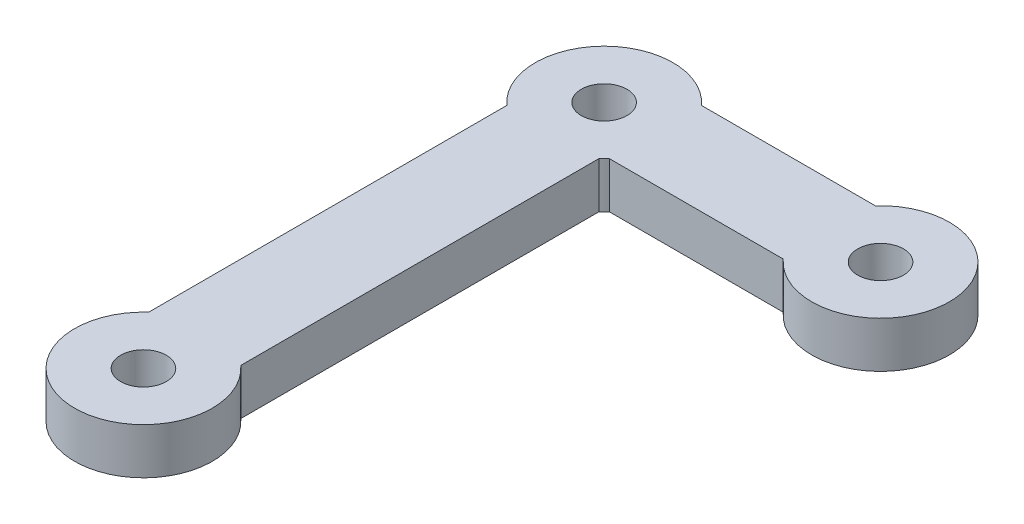
ISO-10303-21;
HEADER;
FILE_DESCRIPTION(('STEP AP214'),'2;1');
FILE_NAME('part.step','',(''),(''),'','','');
FILE_SCHEMA(('AUTOMOTIVE_DESIGN { 1 0 10303 214 1 1 1 1 }'));
ENDSEC;
DATA;
#1=APPLICATION_CONTEXT('core data for automotive mechanical design processes');
#2=APPLICATION_PROTOCOL_DEFINITION('international standard','automotive_design',2000,#1);
#3=PRODUCT_CONTEXT('',#1,'mechanical');
#4=PRODUCT('Part','Part','',(#3));
#5=PRODUCT_RELATED_PRODUCT_CATEGORY('part','',(#4));
#6=PRODUCT_DEFINITION_FORMATION('','',#4);
#7=PRODUCT_DEFINITION_CONTEXT('part definition',#1,'design');
#8=PRODUCT_DEFINITION('design','',#6,#7);
#9=PRODUCT_DEFINITION_SHAPE('','',#8);
#10=(LENGTH_UNIT() NAMED_UNIT(*) SI_UNIT(.MILLI.,.METRE.));
#11=(NAMED_UNIT(*) PLANE_ANGLE_UNIT() SI_UNIT($,.RADIAN.));
#12=(NAMED_UNIT(*) SI_UNIT($,.STERADIAN.) SOLID_ANGLE_UNIT());
#13=UNCERTAINTY_MEASURE_WITH_UNIT(LENGTH_MEASURE(1.E-05),#10,'distance_accuracy_value','');
#14=(GEOMETRIC_REPRESENTATION_CONTEXT(3) GLOBAL_UNCERTAINTY_ASSIGNED_CONTEXT((#13)) GLOBAL_UNIT_ASSIGNED_CONTEXT((#10,
#11,#12)) REPRESENTATION_CONTEXT('',''));
#15=CARTESIAN_POINT('',(0.,0.,0.));
#16=DIRECTION('',(0.,0.,1.));
#17=DIRECTION('',(1.,0.,0.));
#18=AXIS2_PLACEMENT_3D('',#15,#16,#17);
#19=CARTESIAN_POINT('',(-32.2589762582874,-15.7067029241854,-2.73641625173114));
#20=DIRECTION('',(0.,-1.,0.));
#21=DIRECTION('',(0.,0.,-1.));
#22=AXIS2_PLACEMENT_3D('',#19,#20,#21);
#23=CYLINDRICAL_SURFACE('',#22,4.75);
#24=DIRECTION('',(0.,-1.,0.));
#25=VECTOR('',#24,1.);
#26=CARTESIAN_POINT('',(-28.7260065442933,6.67638257835148,0.438583748268859));
#27=LINE('',#26,#25);
#28=CARTESIAN_POINT('',(-28.7260065442933,-15.7067029241854,0.438583748268859));
#29=VERTEX_POINT('',#28);
#30=CARTESIAN_POINT('',(-28.7260065442933,-18.8817029241854,0.438583748268859));
#31=VERTEX_POINT('',#30);
#32=EDGE_CURVE('E58',#29,#31,#27,.T.);
#33=ORIENTED_EDGE('',*,*,#32,.F.);
#34=CARTESIAN_POINT('',(-32.2589762582874,-15.7067029241854,-2.73641625173114));
#35=DIRECTION('',(0.,1.,0.));
#36=DIRECTION('',(0.,0.,1.));
#37=AXIS2_PLACEMENT_3D('',#34,#35,#36);
#38=CIRCLE('',#37,4.75);
#39=CARTESIAN_POINT('',(-29.0839762582874,-15.7067029241854,0.796553462263021));
#40=VERTEX_POINT('',#39);
#41=EDGE_CURVE('E108',#40,#29,#38,.T.);
#42=ORIENTED_EDGE('',*,*,#41,.F.);
#43=DIRECTION('',(0.,-1.,0.));
#44=VECTOR('',#43,1.);
#45=CARTESIAN_POINT('',(-29.0839762582874,-15.7067029241854,0.796553462263021));
#46=LINE('',#45,#44);
#47=CARTESIAN_POINT('',(-29.0839762582874,-18.8817029241854,0.796553462263021));
#48=VERTEX_POINT('',#47);
#49=EDGE_CURVE('E43',#40,#48,#46,.T.);
#50=ORIENTED_EDGE('',*,*,#49,.T.);
#51=CARTESIAN_POINT('',(-32.2589762582874,-18.8817029241854,-2.73641625173114));
#52=DIRECTION('',(0.,1.,0.));
#53=DIRECTION('',(0.,0.,1.));
#54=AXIS2_PLACEMENT_3D('',#51,#52,#53);
#55=CIRCLE('',#54,4.75);
#56=EDGE_CURVE('E163',#48,#31,#55,.T.);
#57=ORIENTED_EDGE('',*,*,#56,.T.);
#58=EDGE_LOOP('',(#33,#42,#50,#57));
#59=FACE_BOUND('',#58,.T.);
#60=ADVANCED_FACE('F35',(#59),#23,.T.);
#61=CARTESIAN_POINT('',(-32.2589762582874,-15.7067029241854,29.0135837482689));
#62=DIRECTION('',(0.,-1.,0.));
#63=DIRECTION('',(0.,0.,-1.));
#64=AXIS2_PLACEMENT_3D('',#61,#62,#63);
#65=CYLINDRICAL_SURFACE('',#64,4.75);
#66=CARTESIAN_POINT('',(-32.2589762582874,-18.8817029241854,29.0135837482689));
#67=DIRECTION('',(0.,1.,0.));
#68=DIRECTION('',(0.,0.,1.));
#69=AXIS2_PLACEMENT_3D('',#66,#67,#68);
#70=CIRCLE('',#69,4.75);
#71=CARTESIAN_POINT('',(-35.4339762582874,-18.8817029241854,25.4806140342747));
#72=VERTEX_POINT('',#71);
#73=CARTESIAN_POINT('',(-29.0839762582874,-18.8817029241854,25.4806140342747));
#74=VERTEX_POINT('',#73);
#75=EDGE_CURVE('E156',#72,#74,#70,.T.);
#76=ORIENTED_EDGE('',*,*,#75,.T.);
#77=DIRECTION('',(0.,-1.,0.));
#78=VECTOR('',#77,1.);
#79=CARTESIAN_POINT('',(-29.0839762582874,-15.7067029241854,25.4806140342747));
#80=LINE('',#79,#78);
#81=CARTESIAN_POINT('',(-29.0839762582874,-15.7067029241854,25.4806140342747));
#82=VERTEX_POINT('',#81);
#83=EDGE_CURVE('E11',#82,#74,#80,.T.);
#84=ORIENTED_EDGE('',*,*,#83,.F.);
#85=CARTESIAN_POINT('',(-32.2589762582874,-15.7067029241854,29.0135837482689));
#86=DIRECTION('',(0.,1.,0.));
#87=DIRECTION('',(0.,0.,1.));
#88=AXIS2_PLACEMENT_3D('',#85,#86,#87);
#89=CIRCLE('',#88,4.75);
#90=CARTESIAN_POINT('',(-35.4339762582874,-15.7067029241854,25.4806140342747));
#91=VERTEX_POINT('',#90);
#92=EDGE_CURVE('E140',#91,#82,#89,.T.);
#93=ORIENTED_EDGE('',*,*,#92,.F.);
#94=DIRECTION('',(0.,-1.,0.));
#95=VECTOR('',#94,1.);
#96=CARTESIAN_POINT('',(-35.4339762582874,-15.7067029241854,25.4806140342747));
#97=LINE('',#96,#95);
#98=EDGE_CURVE('E152',#91,#72,#97,.T.);
#99=ORIENTED_EDGE('',*,*,#98,.T.);
#100=EDGE_LOOP('',(#76,#84,#93,#99));
#101=FACE_BOUND('',#100,.T.);
#102=ADVANCED_FACE('F184',(#101),#65,.T.);
#103=CARTESIAN_POINT('',(-29.0839762582874,-15.7067029241854,-2.73641625173114));
#104=DIRECTION('',(1.,0.,0.));
#105=DIRECTION('',(0.,0.,-1.));
#106=AXIS2_PLACEMENT_3D('',#103,#104,#105);
#107=PLANE('',#106);
#108=DIRECTION('',(0.,0.,1.));
#109=VECTOR('',#108,1.);
#110=CARTESIAN_POINT('',(-29.0839762582874,-18.8817029241854,-2.73641625173114));
#111=LINE('',#110,#109);
#112=EDGE_CURVE('E159',#48,#74,#111,.T.);
#113=ORIENTED_EDGE('',*,*,#112,.F.);
#114=ORIENTED_EDGE('',*,*,#49,.F.);
#115=DIRECTION('',(0.,0.,1.));
#116=VECTOR('',#115,1.);
#117=CARTESIAN_POINT('',(-29.0839762582874,-15.7067029241854,-2.73641625173114));
#118=LINE('',#117,#116);
#119=EDGE_CURVE('E143',#40,#82,#118,.T.);
#120=ORIENTED_EDGE('',*,*,#119,.T.);
#121=ORIENTED_EDGE('',*,*,#83,.T.);
#122=EDGE_LOOP('',(#113,#114,#120,#121));
#123=FACE_BOUND('',#122,.T.);
#124=ADVANCED_FACE('F180',(#123),#107,.T.);
#125=CARTESIAN_POINT('',(-28.7260065442933,-15.7067029241854,-5.91141625173114));
#126=VERTEX_POINT('',#125);
#127=CARTESIAN_POINT('',(-35.4339762582874,-15.7067029241854,0.796553462263021));
#128=VERTEX_POINT('',#127);
#129=EDGE_CURVE('E50',#126,#128,#38,.T.);
#130=ORIENTED_EDGE('',*,*,#129,.F.);
#131=DIRECTION('',(0.,-1.,0.));
#132=VECTOR('',#131,1.);
#133=CARTESIAN_POINT('',(-28.7260065442933,6.67638257835148,-5.91141625173114));
#134=LINE('',#133,#132);
#135=CARTESIAN_POINT('',(-28.7260065442933,-18.8817029241854,-5.91141625173114));
#136=VERTEX_POINT('',#135);
#137=EDGE_CURVE('E133',#126,#136,#134,.T.);
#138=ORIENTED_EDGE('',*,*,#137,.T.);
#139=CARTESIAN_POINT('',(-35.4339762582874,-18.8817029241854,0.796553462263021));
#140=VERTEX_POINT('',#139);
#141=EDGE_CURVE('E162',#136,#140,#55,.T.);
#142=ORIENTED_EDGE('',*,*,#141,.T.);
#143=DIRECTION('',(0.,-1.,0.));
#144=VECTOR('',#143,1.);
#145=CARTESIAN_POINT('',(-35.4339762582874,-15.7067029241854,0.796553462263021));
#146=LINE('',#145,#144);
#147=EDGE_CURVE('E171',#128,#140,#146,.T.);
#148=ORIENTED_EDGE('',*,*,#147,.F.);
#149=EDGE_LOOP('',(#130,#138,#142,#148));
#150=FACE_BOUND('',#149,.T.);
#151=ADVANCED_FACE('F191',(#150),#23,.T.);
#152=CARTESIAN_POINT('',(-35.4339762582874,-15.7067029241854,-2.73641625173114));
#153=DIRECTION('',(1.,0.,0.));
#154=DIRECTION('',(0.,0.,-1.));
#155=AXIS2_PLACEMENT_3D('',#152,#153,#154);
#156=PLANE('',#155);
#157=DIRECTION('',(0.,0.,1.));
#158=VECTOR('',#157,1.);
#159=CARTESIAN_POINT('',(-35.4339762582874,-18.8817029241854,-2.73641625173114));
#160=LINE('',#159,#158);
#161=EDGE_CURVE('E165',#140,#72,#160,.T.);
#162=ORIENTED_EDGE('',*,*,#161,.T.);
#163=ORIENTED_EDGE('',*,*,#98,.F.);
#164=DIRECTION('',(0.,0.,1.));
#165=VECTOR('',#164,1.);
#166=CARTESIAN_POINT('',(-35.4339762582874,-15.7067029241854,-2.73641625173114));
#167=LINE('',#166,#165);
#168=EDGE_CURVE('E147',#128,#91,#167,.T.);
#169=ORIENTED_EDGE('',*,*,#168,.F.);
#170=ORIENTED_EDGE('',*,*,#147,.T.);
#171=EDGE_LOOP('',(#162,#163,#169,#170));
#172=FACE_BOUND('',#171,.T.);
#173=ADVANCED_FACE('F189',(#172),#156,.F.);
#174=CARTESIAN_POINT('',(-32.2589762582874,-15.7067029241854,29.0135837482689));
#175=DIRECTION('',(0.,-1.,0.));
#176=DIRECTION('',(0.,0.,-1.));
#177=AXIS2_PLACEMENT_3D('',#174,#175,#176);
#178=CYLINDRICAL_SURFACE('',#177,1.575);
#179=CARTESIAN_POINT('',(-32.2589762582874,-15.7067029241854,29.0135837482689));
#180=DIRECTION('',(0.,1.,0.));
#181=DIRECTION('',(0.,0.,1.));
#182=AXIS2_PLACEMENT_3D('',#179,#180,#181);
#183=CIRCLE('',#182,1.575);
#184=CARTESIAN_POINT('',(-32.2589762582874,-15.7067029241854,30.5885837482689));
#185=VERTEX_POINT('',#184);
#186=EDGE_CURVE('E137',#185,#185,#183,.T.);
#187=ORIENTED_EDGE('',*,*,#186,.T.);
#188=EDGE_LOOP('',(#187));
#189=FACE_BOUND('',#188,.T.);
#190=CARTESIAN_POINT('',(-32.2589762582874,-18.8817029241854,29.0135837482689));
#191=DIRECTION('',(0.,1.,0.));
#192=DIRECTION('',(0.,0.,1.));
#193=AXIS2_PLACEMENT_3D('',#190,#191,#192);
#194=CIRCLE('',#193,1.575);
#195=CARTESIAN_POINT('',(-32.2589762582874,-18.8817029241854,30.5885837482689));
#196=VERTEX_POINT('',#195);
#197=EDGE_CURVE('E153',#196,#196,#194,.T.);
#198=ORIENTED_EDGE('',*,*,#197,.F.);
#199=EDGE_LOOP('',(#198));
#200=FACE_BOUND('',#199,.T.);
#201=ADVANCED_FACE('F37',(#189,#200),#178,.F.);
#202=CARTESIAN_POINT('',(-32.2589762582874,-15.7067029241854,-2.73641625173114));
#203=DIRECTION('',(0.,-1.,0.));
#204=DIRECTION('',(0.,0.,-1.));
#205=AXIS2_PLACEMENT_3D('',#202,#203,#204);
#206=CYLINDRICAL_SURFACE('',#205,1.575);
#207=CARTESIAN_POINT('',(-32.2589762582874,-15.7067029241854,-2.73641625173114));
#208=DIRECTION('',(0.,1.,0.));
#209=DIRECTION('',(0.,0.,1.));
#210=AXIS2_PLACEMENT_3D('',#207,#208,#209);
#211=CIRCLE('',#210,1.575);
#212=CARTESIAN_POINT('',(-32.2589762582874,-15.7067029241854,-1.16141625173114));
#213=VERTEX_POINT('',#212);
#214=EDGE_CURVE('E149',#213,#213,#211,.T.);
#215=ORIENTED_EDGE('',*,*,#214,.T.);
#216=EDGE_LOOP('',(#215));
#217=FACE_BOUND('',#216,.T.);
#218=CARTESIAN_POINT('',(-32.2589762582874,-18.8817029241854,-2.73641625173114));
#219=DIRECTION('',(0.,1.,0.));
#220=DIRECTION('',(0.,0.,1.));
#221=AXIS2_PLACEMENT_3D('',#218,#219,#220);
#222=CIRCLE('',#221,1.575);
#223=CARTESIAN_POINT('',(-32.2589762582874,-18.8817029241854,-1.16141625173114));
#224=VERTEX_POINT('',#223);
#225=EDGE_CURVE('E141',#224,#224,#222,.T.);
#226=ORIENTED_EDGE('',*,*,#225,.F.);
#227=EDGE_LOOP('',(#226));
#228=FACE_BOUND('',#227,.T.);
#229=ADVANCED_FACE('F213',(#217,#228),#206,.F.);
#230=CARTESIAN_POINT('',(-32.2589762582874,-15.7067029241854,-2.73641625173114));
#231=DIRECTION('',(0.,1.,0.));
#232=DIRECTION('',(0.,0.,1.));
#233=AXIS2_PLACEMENT_3D('',#230,#231,#232);
#234=PLANE('',#233);
#235=ORIENTED_EDGE('',*,*,#186,.F.);
#236=EDGE_LOOP('',(#235));
#237=FACE_BOUND('',#236,.T.);
#238=ORIENTED_EDGE('',*,*,#92,.T.);
#239=ORIENTED_EDGE('',*,*,#119,.F.);
#240=ORIENTED_EDGE('',*,*,#41,.T.);
#241=DIRECTION('',(1.,0.,0.));
#242=VECTOR('',#241,1.);
#243=CARTESIAN_POINT('',(0.,-15.7067029241854,0.438583748268859));
#244=LINE('',#243,#242);
#245=CARTESIAN_POINT('',(-16.7419459722816,-15.7067029241854,0.438583748268858));
#246=VERTEX_POINT('',#245);
#247=EDGE_CURVE('E100',#29,#246,#244,.T.);
#248=ORIENTED_EDGE('',*,*,#247,.T.);
#249=CARTESIAN_POINT('',(-13.2089762582874,-15.7067029241854,-2.73641625173114));
#250=DIRECTION('',(0.,1.,0.));
#251=DIRECTION('',(0.,0.,1.));
#252=AXIS2_PLACEMENT_3D('',#249,#250,#251);
#253=CIRCLE('',#252,4.75);
#254=CARTESIAN_POINT('',(-16.7419459722816,-15.7067029241854,-5.91141625173114));
#255=VERTEX_POINT('',#254);
#256=EDGE_CURVE('E105',#255,#246,#253,.F.);
#257=ORIENTED_EDGE('',*,*,#256,.F.);
#258=DIRECTION('',(1.,0.,0.));
#259=VECTOR('',#258,1.);
#260=CARTESIAN_POINT('',(0.,-15.7067029241854,-5.91141625173114));
#261=LINE('',#260,#259);
#262=EDGE_CURVE('E131',#126,#255,#261,.T.);
#263=ORIENTED_EDGE('',*,*,#262,.F.);
#264=ORIENTED_EDGE('',*,*,#129,.T.);
#265=ORIENTED_EDGE('',*,*,#168,.T.);
#266=EDGE_LOOP('',(#238,#239,#240,#248,#257,#263,#264,#265));
#267=FACE_BOUND('',#266,.T.);
#268=ORIENTED_EDGE('',*,*,#214,.F.);
#269=EDGE_LOOP('',(#268));
#270=FACE_BOUND('',#269,.T.);
#271=CARTESIAN_POINT('',(-13.2089762582874,-15.7067029241854,-2.73641625173114));
#272=DIRECTION('',(0.,1.,0.));
#273=DIRECTION('',(0.,0.,1.));
#274=AXIS2_PLACEMENT_3D('',#271,#272,#273);
#275=CIRCLE('',#274,1.575);
#276=CARTESIAN_POINT('',(-13.2089762582874,-15.7067029241854,-1.16141625173114));
#277=VERTEX_POINT('',#276);
#278=EDGE_CURVE('E110',#277,#277,#275,.F.);
#279=ORIENTED_EDGE('',*,*,#278,.T.);
#280=EDGE_LOOP('',(#279));
#281=FACE_BOUND('',#280,.T.);
#282=ADVANCED_FACE('F102',(#237,#267,#270,#281),#234,.T.);
#283=CARTESIAN_POINT('',(-32.2589762582874,-18.8817029241854,-2.73641625173114));
#284=DIRECTION('',(0.,1.,0.));
#285=DIRECTION('',(0.,0.,1.));
#286=AXIS2_PLACEMENT_3D('',#283,#284,#285);
#287=PLANE('',#286);
#288=ORIENTED_EDGE('',*,*,#197,.T.);
#289=EDGE_LOOP('',(#288));
#290=FACE_BOUND('',#289,.T.);
#291=ORIENTED_EDGE('',*,*,#75,.F.);
#292=ORIENTED_EDGE('',*,*,#161,.F.);
#293=ORIENTED_EDGE('',*,*,#141,.F.);
#294=DIRECTION('',(1.,0.,0.));
#295=VECTOR('',#294,1.);
#296=CARTESIAN_POINT('',(0.,-18.8817029241854,-5.91141625173114));
#297=LINE('',#296,#295);
#298=CARTESIAN_POINT('',(-16.7419459722816,-18.8817029241854,-5.91141625173114));
#299=VERTEX_POINT('',#298);
#300=EDGE_CURVE('E195',#136,#299,#297,.T.);
#301=ORIENTED_EDGE('',*,*,#300,.T.);
#302=CARTESIAN_POINT('',(-13.2089762582874,-18.8817029241854,-2.73641625173114));
#303=DIRECTION('',(0.,-1.,0.));
#304=DIRECTION('',(0.,0.,-1.));
#305=AXIS2_PLACEMENT_3D('',#302,#303,#304);
#306=CIRCLE('',#305,4.75);
#307=CARTESIAN_POINT('',(-16.7419459722816,-18.8817029241854,0.438583748268858));
#308=VERTEX_POINT('',#307);
#309=EDGE_CURVE('E111',#299,#308,#306,.T.);
#310=ORIENTED_EDGE('',*,*,#309,.T.);
#311=DIRECTION('',(1.,0.,0.));
#312=VECTOR('',#311,1.);
#313=CARTESIAN_POINT('',(0.,-18.8817029241854,0.438583748268859));
#314=LINE('',#313,#312);
#315=EDGE_CURVE('E117',#31,#308,#314,.T.);
#316=ORIENTED_EDGE('',*,*,#315,.F.);
#317=ORIENTED_EDGE('',*,*,#56,.F.);
#318=ORIENTED_EDGE('',*,*,#112,.T.);
#319=EDGE_LOOP('',(#291,#292,#293,#301,#310,#316,#317,#318));
#320=FACE_BOUND('',#319,.T.);
#321=ORIENTED_EDGE('',*,*,#225,.T.);
#322=EDGE_LOOP('',(#321));
#323=FACE_BOUND('',#322,.T.);
#324=CARTESIAN_POINT('',(-13.2089762582874,-18.8817029241854,-2.73641625173114));
#325=DIRECTION('',(0.,-1.,0.));
#326=DIRECTION('',(0.,0.,-1.));
#327=AXIS2_PLACEMENT_3D('',#324,#325,#326);
#328=CIRCLE('',#327,1.575);
#329=CARTESIAN_POINT('',(-13.2089762582874,-18.8817029241854,-4.31141625173114));
#330=VERTEX_POINT('',#329);
#331=EDGE_CURVE('E121',#330,#330,#328,.T.);
#332=ORIENTED_EDGE('',*,*,#331,.F.);
#333=EDGE_LOOP('',(#332));
#334=FACE_BOUND('',#333,.T.);
#335=ADVANCED_FACE('F178',(#290,#320,#323,#334),#287,.F.);
#336=CARTESIAN_POINT('',(0.,6.67638257835148,-5.91141625173114));
#337=DIRECTION('',(0.,0.,-1.));
#338=DIRECTION('',(-1.,0.,0.));
#339=AXIS2_PLACEMENT_3D('',#336,#337,#338);
#340=PLANE('',#339);
#341=ORIENTED_EDGE('',*,*,#137,.F.);
#342=ORIENTED_EDGE('',*,*,#262,.T.);
#343=DIRECTION('',(0.,-1.,0.));
#344=VECTOR('',#343,1.);
#345=CARTESIAN_POINT('',(-16.7419459722816,6.67638257835148,-5.91141625173114));
#346=LINE('',#345,#344);
#347=EDGE_CURVE('E125',#255,#299,#346,.T.);
#348=ORIENTED_EDGE('',*,*,#347,.T.);
#349=ORIENTED_EDGE('',*,*,#300,.F.);
#350=EDGE_LOOP('',(#341,#342,#348,#349));
#351=FACE_BOUND('',#350,.T.);
#352=ADVANCED_FACE('F196',(#351),#340,.T.);
#353=CARTESIAN_POINT('',(0.,6.67638257835148,0.438583748268859));
#354=DIRECTION('',(0.,0.,-1.));
#355=DIRECTION('',(-1.,0.,0.));
#356=AXIS2_PLACEMENT_3D('',#353,#354,#355);
#357=PLANE('',#356);
#358=ORIENTED_EDGE('',*,*,#247,.F.);
#359=ORIENTED_EDGE('',*,*,#32,.T.);
#360=ORIENTED_EDGE('',*,*,#315,.T.);
#361=DIRECTION('',(0.,-1.,0.));
#362=VECTOR('',#361,1.);
#363=CARTESIAN_POINT('',(-16.7419459722816,6.67638257835148,0.438583748268858));
#364=LINE('',#363,#362);
#365=EDGE_CURVE('E114',#246,#308,#364,.T.);
#366=ORIENTED_EDGE('',*,*,#365,.F.);
#367=EDGE_LOOP('',(#358,#359,#360,#366));
#368=FACE_BOUND('',#367,.T.);
#369=ADVANCED_FACE('F115',(#368),#357,.F.);
#370=CARTESIAN_POINT('',(-13.2089762582874,6.67638257835148,-2.73641625173114));
#371=DIRECTION('',(0.,-1.,0.));
#372=DIRECTION('',(0.,0.,-1.));
#373=AXIS2_PLACEMENT_3D('',#370,#371,#372);
#374=CYLINDRICAL_SURFACE('',#373,4.75);
#375=ORIENTED_EDGE('',*,*,#347,.F.);
#376=ORIENTED_EDGE('',*,*,#256,.T.);
#377=ORIENTED_EDGE('',*,*,#365,.T.);
#378=ORIENTED_EDGE('',*,*,#309,.F.);
#379=EDGE_LOOP('',(#375,#376,#377,#378));
#380=FACE_BOUND('',#379,.T.);
#381=ADVANCED_FACE('F124',(#380),#374,.T.);
#382=CARTESIAN_POINT('',(-13.2089762582874,6.67638257835148,-2.73641625173114));
#383=DIRECTION('',(0.,-1.,0.));
#384=DIRECTION('',(0.,0.,-1.));
#385=AXIS2_PLACEMENT_3D('',#382,#383,#384);
#386=CYLINDRICAL_SURFACE('',#385,1.575);
#387=ORIENTED_EDGE('',*,*,#331,.T.);
#388=EDGE_LOOP('',(#387));
#389=FACE_BOUND('',#388,.T.);
#390=ORIENTED_EDGE('',*,*,#278,.F.);
#391=EDGE_LOOP('',(#390));
#392=FACE_BOUND('',#391,.T.);
#393=ADVANCED_FACE('F202',(#389,#392),#386,.F.);
#394=CLOSED_SHELL('',(#60,#102,#124,#151,#173,#201,#229,#282,#335,#352,#369,#381,#393));
#395=MANIFOLD_SOLID_BREP('B2',#394);
#396=ADVANCED_BREP_SHAPE_REPRESENTATION('',(#18,#395),#14);
#397=SHAPE_DEFINITION_REPRESENTATION(#9,#396);
ENDSEC;
END-ISO-10303-21;
